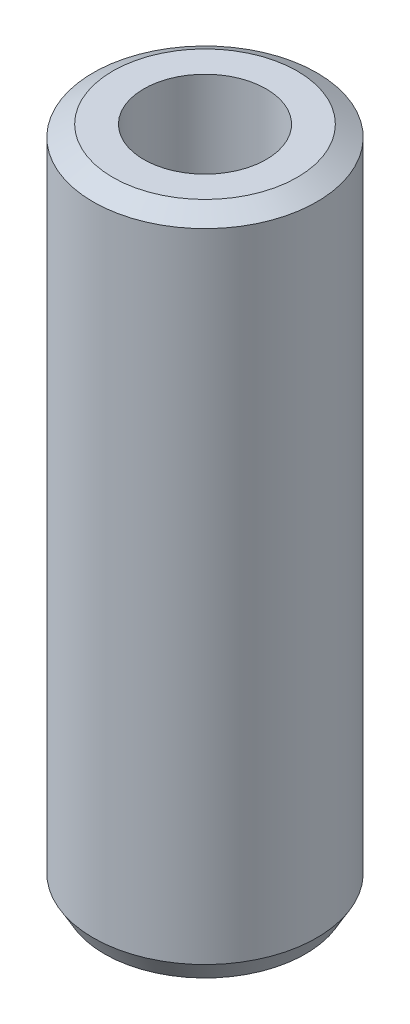
ISO-10303-21;
HEADER;
FILE_DESCRIPTION(('STEP AP214'),'2;1');
FILE_NAME('part.step','',(''),(''),'','','');
FILE_SCHEMA(('AUTOMOTIVE_DESIGN { 1 0 10303 214 1 1 1 1 }'));
ENDSEC;
DATA;
#1=APPLICATION_CONTEXT('core data for automotive mechanical design processes');
#2=APPLICATION_PROTOCOL_DEFINITION('international standard','automotive_design',2000,#1);
#3=PRODUCT_CONTEXT('',#1,'mechanical');
#4=PRODUCT('Part','Part','',(#3));
#5=PRODUCT_RELATED_PRODUCT_CATEGORY('part','',(#4));
#6=PRODUCT_DEFINITION_FORMATION('','',#4);
#7=PRODUCT_DEFINITION_CONTEXT('part definition',#1,'design');
#8=PRODUCT_DEFINITION('design','',#6,#7);
#9=PRODUCT_DEFINITION_SHAPE('','',#8);
#10=(LENGTH_UNIT() NAMED_UNIT(*) SI_UNIT(.MILLI.,.METRE.));
#11=(NAMED_UNIT(*) PLANE_ANGLE_UNIT() SI_UNIT($,.RADIAN.));
#12=(NAMED_UNIT(*) SI_UNIT($,.STERADIAN.) SOLID_ANGLE_UNIT());
#13=UNCERTAINTY_MEASURE_WITH_UNIT(LENGTH_MEASURE(1.E-05),#10,'distance_accuracy_value','');
#14=(GEOMETRIC_REPRESENTATION_CONTEXT(3) GLOBAL_UNCERTAINTY_ASSIGNED_CONTEXT((#13)) GLOBAL_UNIT_ASSIGNED_CONTEXT((#10,
#11,#12)) REPRESENTATION_CONTEXT('',''));
#15=CARTESIAN_POINT('',(0.,0.,0.));
#16=DIRECTION('',(0.,0.,1.));
#17=DIRECTION('',(1.,0.,0.));
#18=AXIS2_PLACEMENT_3D('',#15,#16,#17);
#19=CARTESIAN_POINT('',(0.,343.542344605589,0.));
#20=DIRECTION('',(0.,-1.,0.));
#21=DIRECTION('',(0.,0.,-1.));
#22=AXIS2_PLACEMENT_3D('',#19,#20,#21);
#23=CYLINDRICAL_SURFACE('',#22,57.5);
#24=CARTESIAN_POINT('',(0.,337.704518245466,0.));
#25=DIRECTION('',(0.,1.,0.));
#26=DIRECTION('',(0.,0.,1.));
#27=AXIS2_PLACEMENT_3D('',#24,#25,#26);
#28=CIRCLE('',#27,57.5);
#29=CARTESIAN_POINT('',(0.,337.704518245466,-57.5));
#30=VERTEX_POINT('',#29);
#31=EDGE_CURVE('E50',#30,#30,#28,.F.);
#32=CARTESIAN_POINT('',(0.,10.1114118614971,0.));
#33=DIRECTION('',(0.,1.,0.));
#34=DIRECTION('',(0.,0.,1.));
#35=AXIS2_PLACEMENT_3D('',#32,#33,#34);
#36=CIRCLE('',#35,57.5);
#37=CARTESIAN_POINT('',(0.,10.1114118614971,-57.5));
#38=VERTEX_POINT('',#37);
#39=EDGE_CURVE('E51',#38,#38,#36,.T.);
#40=CARTESIAN_POINT('',(0.,337.704518245466,-57.5));
#41=CARTESIAN_POINT('',(0.,334.292090053966,-57.5));
#42=CARTESIAN_POINT('',(0.,330.879661862467,-57.5));
#43=CARTESIAN_POINT('',(0.,324.054805479467,-57.5));
#44=CARTESIAN_POINT('',(0.,320.642377287968,-57.5));
#45=CARTESIAN_POINT('',(0.,313.817520904968,-57.5));
#46=CARTESIAN_POINT('',(0.,310.405092713469,-57.5));
#47=CARTESIAN_POINT('',(0.,303.580236330469,-57.5));
#48=CARTESIAN_POINT('',(0.,300.16780813897,-57.5));
#49=CARTESIAN_POINT('',(0.,293.34295175597,-57.5));
#50=CARTESIAN_POINT('',(0.,289.930523564471,-57.5));
#51=CARTESIAN_POINT('',(0.,283.105667181471,-57.5));
#52=CARTESIAN_POINT('',(0.,279.693238989972,-57.5));
#53=CARTESIAN_POINT('',(0.,272.868382606972,-57.5));
#54=CARTESIAN_POINT('',(0.,269.455954415473,-57.5));
#55=CARTESIAN_POINT('',(0.,262.631098032473,-57.5));
#56=CARTESIAN_POINT('',(0.,259.218669840974,-57.5));
#57=CARTESIAN_POINT('',(0.,252.393813457974,-57.5));
#58=CARTESIAN_POINT('',(0.,248.981385266475,-57.5));
#59=CARTESIAN_POINT('',(0.,242.156528883475,-57.5));
#60=CARTESIAN_POINT('',(0.,238.744100691976,-57.5));
#61=CARTESIAN_POINT('',(0.,231.919244308976,-57.5));
#62=CARTESIAN_POINT('',(0.,228.506816117476,-57.5));
#63=CARTESIAN_POINT('',(0.,221.681959734477,-57.5));
#64=CARTESIAN_POINT('',(0.,218.269531542977,-57.5));
#65=CARTESIAN_POINT('',(0.,211.444675159978,-57.5));
#66=CARTESIAN_POINT('',(0.,208.032246968478,-57.5));
#67=CARTESIAN_POINT('',(0.,201.207390585479,-57.5));
#68=CARTESIAN_POINT('',(0.,197.794962393979,-57.5));
#69=CARTESIAN_POINT('',(0.,190.97010601098,-57.5));
#70=CARTESIAN_POINT('',(0.,187.55767781948,-57.5));
#71=CARTESIAN_POINT('',(0.,180.732821436481,-57.5));
#72=CARTESIAN_POINT('',(0.,177.320393244981,-57.5));
#73=CARTESIAN_POINT('',(0.,170.495536861982,-57.5));
#74=CARTESIAN_POINT('',(0.,167.083108670482,-57.5));
#75=CARTESIAN_POINT('',(0.,160.258252287483,-57.5));
#76=CARTESIAN_POINT('',(0.,156.845824095983,-57.5));
#77=CARTESIAN_POINT('',(0.,150.020967712984,-57.5));
#78=CARTESIAN_POINT('',(0.,146.608539521484,-57.5));
#79=CARTESIAN_POINT('',(0.,139.783683138485,-57.5));
#80=CARTESIAN_POINT('',(0.,136.371254946985,-57.5));
#81=CARTESIAN_POINT('',(0.,129.546398563986,-57.5));
#82=CARTESIAN_POINT('',(0.,126.133970372486,-57.5));
#83=CARTESIAN_POINT('',(0.,119.309113989487,-57.5));
#84=CARTESIAN_POINT('',(0.,115.896685797987,-57.5));
#85=CARTESIAN_POINT('',(0.,109.071829414988,-57.5));
#86=CARTESIAN_POINT('',(0.,105.659401223488,-57.5));
#87=CARTESIAN_POINT('',(0.,98.8345448404887,-57.5));
#88=CARTESIAN_POINT('',(0.,95.422116648989,-57.5));
#89=CARTESIAN_POINT('',(0.,88.5972602659897,-57.5));
#90=CARTESIAN_POINT('',(0.,85.18483207449,-57.5));
#91=CARTESIAN_POINT('',(0.,78.3599756914906,-57.5));
#92=CARTESIAN_POINT('',(0.,74.9475474999909,-57.5));
#93=CARTESIAN_POINT('',(0.,68.1226911169916,-57.5));
#94=CARTESIAN_POINT('',(0.,64.7102629254919,-57.5));
#95=CARTESIAN_POINT('',(0.,57.8854065424926,-57.5));
#96=CARTESIAN_POINT('',(0.,54.4729783509929,-57.5));
#97=CARTESIAN_POINT('',(0.,47.6481219679935,-57.5));
#98=CARTESIAN_POINT('',(0.,44.2356937764938,-57.5));
#99=CARTESIAN_POINT('',(0.,37.4108373934945,-57.5));
#100=CARTESIAN_POINT('',(0.,33.9984092019948,-57.5));
#101=CARTESIAN_POINT('',(0.,27.1735528189955,-57.5));
#102=CARTESIAN_POINT('',(0.,23.7611246274958,-57.5));
#103=CARTESIAN_POINT('',(0.,16.9362682444964,-57.5));
#104=CARTESIAN_POINT('',(0.,13.5238400529967,-57.5));
#105=CARTESIAN_POINT('',(0.,10.1114118614971,-57.5));
#106=B_SPLINE_CURVE_WITH_KNOTS('',3,(#40,#41,#42,#43,#44,#45,#46,#47,#48,#49,#50,#51,#52,#53,
#54,#55,#56,#57,#58,#59,#60,#61,#62,#63,#64,#65,#66,#67,#68,#69,#70,#71,#72,#73,#74,#75,#76,#77,
#78,#79,#80,#81,#82,#83,#84,#85,#86,#87,#88,#89,#90,#91,#92,#93,#94,#95,#96,#97,#98,#99,#100,
#101,#102,#103,#104,#105),.UNSPECIFIED.,.F.,.F.,(4,2,2,2,2,2,2,2,2,2,2,2,2,2,2,2,2,2,2,2,2,2,2,
2,2,2,2,2,2,2,2,2,4),(0.,10.237284574499,20.474569148998,30.7118537234971,40.9491382979961,
51.1864228724951,61.4237074469942,71.6609920214932,81.8982765959922,92.1355611704913,
102.37284574499,112.610130319489,122.847414893988,133.084699468487,143.321984042986,
153.559268617485,163.796553191985,174.033837766484,184.271122340983,194.508406915482,
204.745691489981,214.98297606448,225.220260638979,235.457545213478,245.694829787977,
255.932114362476,266.169398936975,276.406683511474,286.643968085973,296.881252660472,
307.118537234971,317.35582180947,327.593106383969),.UNSPECIFIED.);
#107=EDGE_CURVE('BSEAM39',#30,#38,#106,.T.);
#108=ORIENTED_EDGE('',*,*,#31,.T.);
#109=ORIENTED_EDGE('',*,*,#39,.T.);
#110=ORIENTED_EDGE('',*,*,#107,.T.);
#111=ORIENTED_EDGE('',*,*,#107,.F.);
#112=EDGE_LOOP('',(#108,#110,#109,#111));
#113=FACE_BOUND('',#112,.T.);
#114=ADVANCED_FACE('F39',(#113),#23,.T.);
#115=CARTESIAN_POINT('',(0.,343.542344605589,0.));
#116=DIRECTION('',(0.,1.,0.));
#117=DIRECTION('',(0.,0.,1.));
#118=AXIS2_PLACEMENT_3D('',#115,#116,#117);
#119=PLANE('',#118);
#120=CARTESIAN_POINT('',(0.,343.542344605589,0.));
#121=DIRECTION('',(0.,1.,0.));
#122=DIRECTION('',(0.,0.,1.));
#123=AXIS2_PLACEMENT_3D('',#120,#121,#122);
#124=CIRCLE('',#123,47.3885881385033);
#125=CARTESIAN_POINT('',(0.,343.542344605589,47.3885881385033));
#126=VERTEX_POINT('',#125);
#127=EDGE_CURVE('E54',#126,#126,#124,.T.);
#128=ORIENTED_EDGE('',*,*,#127,.T.);
#129=EDGE_LOOP('',(#128));
#130=FACE_BOUND('',#129,.T.);
#131=CARTESIAN_POINT('',(0.,343.542344605589,0.));
#132=DIRECTION('',(0.,1.,0.));
#133=DIRECTION('',(0.,0.,1.));
#134=AXIS2_PLACEMENT_3D('',#131,#132,#133);
#135=CIRCLE('',#134,31.4743864520325);
#136=CARTESIAN_POINT('',(0.,343.542344605589,-31.4743864520325));
#137=VERTEX_POINT('',#136);
#138=EDGE_CURVE('E58',#137,#137,#135,.T.);
#139=ORIENTED_EDGE('',*,*,#138,.F.);
#140=EDGE_LOOP('',(#139));
#141=FACE_BOUND('',#140,.T.);
#142=ADVANCED_FACE('F69',(#130,#141),#119,.T.);
#143=CARTESIAN_POINT('',(0.,0.,0.));
#144=DIRECTION('',(0.,1.,0.));
#145=DIRECTION('',(0.,0.,1.));
#146=AXIS2_PLACEMENT_3D('',#143,#144,#145);
#147=PLANE('',#146);
#148=CARTESIAN_POINT('',(0.,0.,0.));
#149=DIRECTION('',(0.,1.,0.));
#150=DIRECTION('',(0.,0.,1.));
#151=AXIS2_PLACEMENT_3D('',#148,#149,#150);
#152=CIRCLE('',#151,51.6621736398775);
#153=CARTESIAN_POINT('',(0.,0.,51.6621736398775));
#154=VERTEX_POINT('',#153);
#155=EDGE_CURVE('E10',#154,#154,#152,.F.);
#156=ORIENTED_EDGE('',*,*,#155,.T.);
#157=EDGE_LOOP('',(#156));
#158=FACE_BOUND('',#157,.T.);
#159=CARTESIAN_POINT('',(0.,0.,0.));
#160=DIRECTION('',(0.,1.,0.));
#161=DIRECTION('',(0.,0.,1.));
#162=AXIS2_PLACEMENT_3D('',#159,#160,#161);
#163=CIRCLE('',#162,31.4743864520325);
#164=CARTESIAN_POINT('',(0.,0.,-31.4743864520325));
#165=VERTEX_POINT('',#164);
#166=EDGE_CURVE('E63',#165,#165,#163,.T.);
#167=ORIENTED_EDGE('',*,*,#166,.T.);
#168=EDGE_LOOP('',(#167));
#169=FACE_BOUND('',#168,.T.);
#170=ADVANCED_FACE('F75',(#158,#169),#147,.F.);
#171=CARTESIAN_POINT('',(0.,343.542344605589,0.));
#172=DIRECTION('',(0.,-1.,0.));
#173=DIRECTION('',(0.,0.,-1.));
#174=AXIS2_PLACEMENT_3D('',#171,#172,#173);
#175=CYLINDRICAL_SURFACE('',#174,31.4743864520325);
#176=CARTESIAN_POINT('',(0.,343.542344605589,-31.4743864520325));
#177=CARTESIAN_POINT('',(0.,339.963778515947,-31.4743864520325));
#178=CARTESIAN_POINT('',(0.,336.385212426305,-31.4743864520325));
#179=CARTESIAN_POINT('',(0.,329.228080247022,-31.4743864520325));
#180=CARTESIAN_POINT('',(0.,325.649514157381,-31.4743864520325));
#181=CARTESIAN_POINT('',(0.,318.492381978098,-31.4743864520325));
#182=CARTESIAN_POINT('',(0.,314.913815888456,-31.4743864520325));
#183=CARTESIAN_POINT('',(0.,307.756683709173,-31.4743864520325));
#184=CARTESIAN_POINT('',(0.,304.178117619531,-31.4743864520325));
#185=CARTESIAN_POINT('',(0.,297.020985440248,-31.4743864520325));
#186=CARTESIAN_POINT('',(0.,293.442419350607,-31.4743864520325));
#187=CARTESIAN_POINT('',(0.,286.285287171324,-31.4743864520325));
#188=CARTESIAN_POINT('',(0.,282.706721081682,-31.4743864520325));
#189=CARTESIAN_POINT('',(0.,275.549588902399,-31.4743864520325));
#190=CARTESIAN_POINT('',(0.,271.971022812758,-31.4743864520325));
#191=CARTESIAN_POINT('',(0.,264.813890633474,-31.4743864520325));
#192=CARTESIAN_POINT('',(0.,261.235324543833,-31.4743864520325));
#193=CARTESIAN_POINT('',(0.,254.07819236455,-31.4743864520325));
#194=CARTESIAN_POINT('',(0.,250.499626274908,-31.4743864520325));
#195=CARTESIAN_POINT('',(0.,243.342494095625,-31.4743864520325));
#196=CARTESIAN_POINT('',(0.,239.763928005984,-31.4743864520325));
#197=CARTESIAN_POINT('',(0.,232.6067958267,-31.4743864520325));
#198=CARTESIAN_POINT('',(0.,229.028229737059,-31.4743864520325));
#199=CARTESIAN_POINT('',(0.,221.871097557776,-31.4743864520325));
#200=CARTESIAN_POINT('',(0.,218.292531468134,-31.4743864520325));
#201=CARTESIAN_POINT('',(0.,211.135399288851,-31.4743864520325));
#202=CARTESIAN_POINT('',(0.,207.55683319921,-31.4743864520325));
#203=CARTESIAN_POINT('',(0.,200.399701019927,-31.4743864520325));
#204=CARTESIAN_POINT('',(0.,196.821134930285,-31.4743864520325));
#205=CARTESIAN_POINT('',(0.,189.664002751002,-31.4743864520325));
#206=CARTESIAN_POINT('',(0.,186.08543666136,-31.4743864520325));
#207=CARTESIAN_POINT('',(0.,178.928304482077,-31.4743864520325));
#208=CARTESIAN_POINT('',(0.,175.349738392436,-31.4743864520325));
#209=CARTESIAN_POINT('',(0.,168.192606213153,-31.4743864520325));
#210=CARTESIAN_POINT('',(0.,164.614040123511,-31.4743864520325));
#211=CARTESIAN_POINT('',(0.,157.456907944228,-31.4743864520325));
#212=CARTESIAN_POINT('',(0.,153.878341854586,-31.4743864520325));
#213=CARTESIAN_POINT('',(0.,146.721209675303,-31.4743864520325));
#214=CARTESIAN_POINT('',(0.,143.142643585662,-31.4743864520325));
#215=CARTESIAN_POINT('',(0.,135.985511406379,-31.4743864520325));
#216=CARTESIAN_POINT('',(0.,132.406945316737,-31.4743864520325));
#217=CARTESIAN_POINT('',(0.,125.249813137454,-31.4743864520325));
#218=CARTESIAN_POINT('',(0.,121.671247047813,-31.4743864520325));
#219=CARTESIAN_POINT('',(0.,114.514114868529,-31.4743864520325));
#220=CARTESIAN_POINT('',(0.,110.935548778888,-31.4743864520325));
#221=CARTESIAN_POINT('',(0.,103.778416599605,-31.4743864520325));
#222=CARTESIAN_POINT('',(0.,100.199850509963,-31.4743864520325));
#223=CARTESIAN_POINT('',(0.,93.0427183306802,-31.4743864520325));
#224=CARTESIAN_POINT('',(0.,89.4641522410386,-31.4743864520325));
#225=CARTESIAN_POINT('',(0.,82.3070200617556,-31.4743864520325));
#226=CARTESIAN_POINT('',(0.,78.728453972114,-31.4743864520325));
#227=CARTESIAN_POINT('',(0.,71.5713217928309,-31.4743864520325));
#228=CARTESIAN_POINT('',(0.,67.9927557031894,-31.4743864520325));
#229=CARTESIAN_POINT('',(0.,60.8356235239063,-31.4743864520325));
#230=CARTESIAN_POINT('',(0.,57.2570574342647,-31.4743864520325));
#231=CARTESIAN_POINT('',(0.,50.0999252549816,-31.4743864520325));
#232=CARTESIAN_POINT('',(0.,46.5213591653401,-31.4743864520325));
#233=CARTESIAN_POINT('',(0.,39.364226986057,-31.4743864520325));
#234=CARTESIAN_POINT('',(0.,35.7856608964154,-31.4743864520325));
#235=CARTESIAN_POINT('',(0.,28.6285287171323,-31.4743864520325));
#236=CARTESIAN_POINT('',(0.,25.0499626274908,-31.4743864520325));
#237=CARTESIAN_POINT('',(0.,17.8928304482077,-31.4743864520325));
#238=CARTESIAN_POINT('',(0.,14.3142643585661,-31.4743864520325));
#239=CARTESIAN_POINT('',(0.,7.15713217928303,-31.4743864520325));
#240=CARTESIAN_POINT('',(0.,3.57856608964149,-31.4743864520325));
#241=CARTESIAN_POINT('',(0.,0.,-31.4743864520325));
#242=B_SPLINE_CURVE_WITH_KNOTS('',3,(#176,#177,#178,#179,#180,#181,#182,#183,#184,#185,#186,
#187,#188,#189,#190,#191,#192,#193,#194,#195,#196,#197,#198,#199,#200,#201,#202,#203,#204,#205,
#206,#207,#208,#209,#210,#211,#212,#213,#214,#215,#216,#217,#218,#219,#220,#221,#222,#223,#224,
#225,#226,#227,#228,#229,#230,#231,#232,#233,#234,#235,#236,#237,#238,#239,#240,#241),
.UNSPECIFIED.,.F.,.F.,(4,2,2,2,2,2,2,2,2,2,2,2,2,2,2,2,2,2,2,2,2,2,2,2,2,2,2,2,2,2,2,2,4),(0.,
10.7356982689247,21.4713965378493,32.207094806774,42.9427930756986,53.6784913446233,
64.4141896135479,75.1498878824725,85.8855861513972,96.6212844203218,107.356982689246,
118.092680958171,128.828379227096,139.56407749602,150.299775764945,161.03547403387,
171.771172302794,182.506870571719,193.242568840644,203.978267109568,214.713965378493,
225.449663647418,236.185361916342,246.921060185267,257.656758454191,268.392456723116,
279.128154992041,289.863853260965,300.59955152989,311.335249798815,322.070948067739,
332.806646336664,343.542344605589),.UNSPECIFIED.);
#243=EDGE_CURVE('BSEAM70',#137,#165,#242,.T.);
#244=ORIENTED_EDGE('',*,*,#138,.T.);
#245=ORIENTED_EDGE('',*,*,#166,.F.);
#246=ORIENTED_EDGE('',*,*,#243,.T.);
#247=ORIENTED_EDGE('',*,*,#243,.F.);
#248=EDGE_LOOP('',(#244,#246,#245,#247));
#249=FACE_BOUND('',#248,.T.);
#250=ADVANCED_FACE('F70',(#249),#175,.F.);
#251=CARTESIAN_POINT('',(0.,343.542344605589,0.));
#252=DIRECTION('',(0.,-1.,0.));
#253=DIRECTION('',(0.,0.,-1.));
#254=AXIS2_PLACEMENT_3D('',#251,#252,#253);
#255=CONICAL_SURFACE('',#254,47.3885881385033,1.0471975511966);
#256=ORIENTED_EDGE('',*,*,#31,.F.);
#257=EDGE_LOOP('',(#256));
#258=FACE_BOUND('',#257,.T.);
#259=ORIENTED_EDGE('',*,*,#127,.F.);
#260=EDGE_LOOP('',(#259));
#261=FACE_BOUND('',#260,.T.);
#262=ADVANCED_FACE('F81',(#258,#261),#255,.T.);
#263=CARTESIAN_POINT('',(0.,10.1114118614971,0.));
#264=DIRECTION('',(0.,1.,0.));
#265=DIRECTION('',(0.,0.,1.));
#266=AXIS2_PLACEMENT_3D('',#263,#264,#265);
#267=CONICAL_SURFACE('',#266,57.5,0.523598775598303);
#268=ORIENTED_EDGE('',*,*,#155,.F.);
#269=EDGE_LOOP('',(#268));
#270=FACE_BOUND('',#269,.T.);
#271=ORIENTED_EDGE('',*,*,#39,.F.);
#272=EDGE_LOOP('',(#271));
#273=FACE_BOUND('',#272,.T.);
#274=ADVANCED_FACE('F45',(#270,#273),#267,.T.);
#275=CLOSED_SHELL('',(#114,#142,#170,#250,#262,#274));
#276=MANIFOLD_SOLID_BREP('B2',#275);
#277=ADVANCED_BREP_SHAPE_REPRESENTATION('',(#18,#276),#14);
#278=SHAPE_DEFINITION_REPRESENTATION(#9,#277);
ENDSEC;
END-ISO-10303-21;
